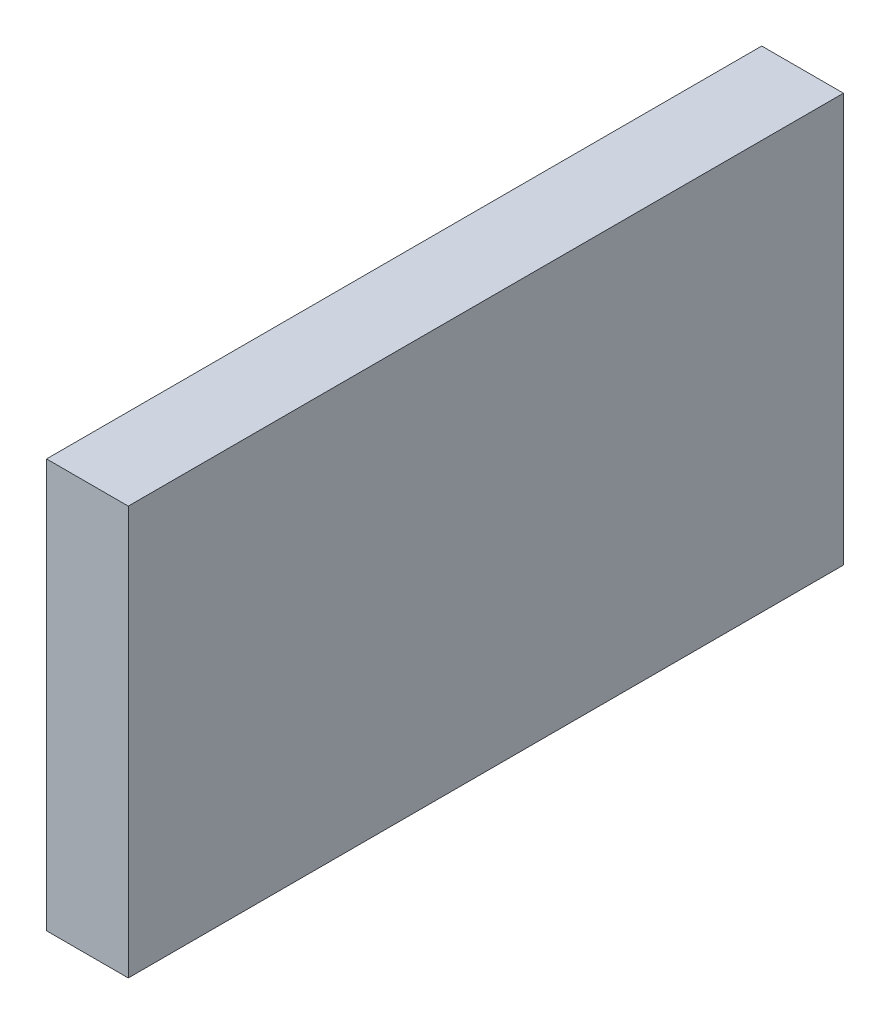
ISO-10303-21;
HEADER;
FILE_DESCRIPTION(('STEP AP214'),'2;1');
FILE_NAME('part.step','',(''),(''),'','','');
FILE_SCHEMA(('AUTOMOTIVE_DESIGN { 1 0 10303 214 1 1 1 1 }'));
ENDSEC;
DATA;
#1=APPLICATION_CONTEXT('core data for automotive mechanical design processes');
#2=APPLICATION_PROTOCOL_DEFINITION('international standard','automotive_design',2000,#1);
#3=PRODUCT_CONTEXT('',#1,'mechanical');
#4=PRODUCT('Part','Part','',(#3));
#5=PRODUCT_RELATED_PRODUCT_CATEGORY('part','',(#4));
#6=PRODUCT_DEFINITION_FORMATION('','',#4);
#7=PRODUCT_DEFINITION_CONTEXT('part definition',#1,'design');
#8=PRODUCT_DEFINITION('design','',#6,#7);
#9=PRODUCT_DEFINITION_SHAPE('','',#8);
#10=(LENGTH_UNIT() NAMED_UNIT(*) SI_UNIT(.MILLI.,.METRE.));
#11=(NAMED_UNIT(*) PLANE_ANGLE_UNIT() SI_UNIT($,.RADIAN.));
#12=(NAMED_UNIT(*) SI_UNIT($,.STERADIAN.) SOLID_ANGLE_UNIT());
#13=UNCERTAINTY_MEASURE_WITH_UNIT(LENGTH_MEASURE(1.E-05),#10,'distance_accuracy_value','');
#14=(GEOMETRIC_REPRESENTATION_CONTEXT(3) GLOBAL_UNCERTAINTY_ASSIGNED_CONTEXT((#13)) GLOBAL_UNIT_ASSIGNED_CONTEXT((#10,
#11,#12)) REPRESENTATION_CONTEXT('',''));
#15=CARTESIAN_POINT('',(0.,0.,0.));
#16=DIRECTION('',(0.,0.,1.));
#17=DIRECTION('',(1.,0.,0.));
#18=AXIS2_PLACEMENT_3D('',#15,#16,#17);
#19=CARTESIAN_POINT('',(4.,20.,-35.));
#20=DIRECTION('',(0.,0.,-1.));
#21=DIRECTION('',(-1.,0.,0.));
#22=AXIS2_PLACEMENT_3D('',#19,#20,#21);
#23=PLANE('',#22);
#24=DIRECTION('',(0.,-1.,0.));
#25=VECTOR('',#24,1.);
#26=CARTESIAN_POINT('',(0.,20.,-35.));
#27=LINE('',#26,#25);
#28=CARTESIAN_POINT('',(0.,20.,-35.));
#29=VERTEX_POINT('',#28);
#30=CARTESIAN_POINT('',(0.,0.,-35.));
#31=VERTEX_POINT('',#30);
#32=EDGE_CURVE('E97',#29,#31,#27,.T.);
#33=ORIENTED_EDGE('',*,*,#32,.F.);
#34=DIRECTION('',(-1.,0.,0.));
#35=VECTOR('',#34,1.);
#36=CARTESIAN_POINT('',(4.,20.,-35.));
#37=LINE('',#36,#35);
#38=CARTESIAN_POINT('',(4.,20.,-35.));
#39=VERTEX_POINT('',#38);
#40=EDGE_CURVE('E11',#39,#29,#37,.T.);
#41=ORIENTED_EDGE('',*,*,#40,.F.);
#42=DIRECTION('',(0.,-1.,0.));
#43=VECTOR('',#42,1.);
#44=CARTESIAN_POINT('',(4.,20.,-35.));
#45=LINE('',#44,#43);
#46=CARTESIAN_POINT('',(4.,0.,-35.));
#47=VERTEX_POINT('',#46);
#48=EDGE_CURVE('E91',#39,#47,#45,.T.);
#49=ORIENTED_EDGE('',*,*,#48,.T.);
#50=DIRECTION('',(-1.,0.,0.));
#51=VECTOR('',#50,1.);
#52=CARTESIAN_POINT('',(4.,0.,-35.));
#53=LINE('',#52,#51);
#54=EDGE_CURVE('E36',#47,#31,#53,.T.);
#55=ORIENTED_EDGE('',*,*,#54,.T.);
#56=EDGE_LOOP('',(#33,#41,#49,#55));
#57=FACE_BOUND('',#56,.T.);
#58=ADVANCED_FACE('F33',(#57),#23,.T.);
#59=CARTESIAN_POINT('',(4.,20.,0.));
#60=DIRECTION('',(0.,1.,0.));
#61=DIRECTION('',(0.,0.,1.));
#62=AXIS2_PLACEMENT_3D('',#59,#60,#61);
#63=PLANE('',#62);
#64=DIRECTION('',(0.,0.,-1.));
#65=VECTOR('',#64,1.);
#66=CARTESIAN_POINT('',(0.,20.,0.));
#67=LINE('',#66,#65);
#68=CARTESIAN_POINT('',(0.,20.,0.));
#69=VERTEX_POINT('',#68);
#70=EDGE_CURVE('E93',#69,#29,#67,.T.);
#71=ORIENTED_EDGE('',*,*,#70,.F.);
#72=DIRECTION('',(-1.,0.,0.));
#73=VECTOR('',#72,1.);
#74=CARTESIAN_POINT('',(4.,20.,0.));
#75=LINE('',#74,#73);
#76=CARTESIAN_POINT('',(4.,20.,0.));
#77=VERTEX_POINT('',#76);
#78=EDGE_CURVE('E42',#77,#69,#75,.T.);
#79=ORIENTED_EDGE('',*,*,#78,.F.);
#80=DIRECTION('',(0.,0.,-1.));
#81=VECTOR('',#80,1.);
#82=CARTESIAN_POINT('',(4.,20.,0.));
#83=LINE('',#82,#81);
#84=EDGE_CURVE('E88',#77,#39,#83,.T.);
#85=ORIENTED_EDGE('',*,*,#84,.T.);
#86=ORIENTED_EDGE('',*,*,#40,.T.);
#87=EDGE_LOOP('',(#71,#79,#85,#86));
#88=FACE_BOUND('',#87,.T.);
#89=ADVANCED_FACE('F107',(#88),#63,.T.);
#90=CARTESIAN_POINT('',(4.,0.,0.));
#91=DIRECTION('',(0.,0.,1.));
#92=DIRECTION('',(1.,0.,0.));
#93=AXIS2_PLACEMENT_3D('',#90,#91,#92);
#94=PLANE('',#93);
#95=DIRECTION('',(0.,1.,0.));
#96=VECTOR('',#95,1.);
#97=CARTESIAN_POINT('',(0.,0.,0.));
#98=LINE('',#97,#96);
#99=CARTESIAN_POINT('',(0.,0.,0.));
#100=VERTEX_POINT('',#99);
#101=EDGE_CURVE('E83',#100,#69,#98,.T.);
#102=ORIENTED_EDGE('',*,*,#101,.F.);
#103=DIRECTION('',(-1.,0.,0.));
#104=VECTOR('',#103,1.);
#105=CARTESIAN_POINT('',(4.,0.,0.));
#106=LINE('',#105,#104);
#107=CARTESIAN_POINT('',(4.,0.,0.));
#108=VERTEX_POINT('',#107);
#109=EDGE_CURVE('E78',#108,#100,#106,.T.);
#110=ORIENTED_EDGE('',*,*,#109,.F.);
#111=DIRECTION('',(0.,1.,0.));
#112=VECTOR('',#111,1.);
#113=CARTESIAN_POINT('',(4.,0.,0.));
#114=LINE('',#113,#112);
#115=EDGE_CURVE('E81',#108,#77,#114,.T.);
#116=ORIENTED_EDGE('',*,*,#115,.T.);
#117=ORIENTED_EDGE('',*,*,#78,.T.);
#118=EDGE_LOOP('',(#102,#110,#116,#117));
#119=FACE_BOUND('',#118,.T.);
#120=ADVANCED_FACE('F80',(#119),#94,.T.);
#121=CARTESIAN_POINT('',(4.,0.,-35.));
#122=DIRECTION('',(0.,-1.,0.));
#123=DIRECTION('',(0.,0.,-1.));
#124=AXIS2_PLACEMENT_3D('',#121,#122,#123);
#125=PLANE('',#124);
#126=DIRECTION('',(0.,0.,1.));
#127=VECTOR('',#126,1.);
#128=CARTESIAN_POINT('',(0.,0.,-35.));
#129=LINE('',#128,#127);
#130=EDGE_CURVE('E100',#31,#100,#129,.T.);
#131=ORIENTED_EDGE('',*,*,#130,.F.);
#132=ORIENTED_EDGE('',*,*,#54,.F.);
#133=DIRECTION('',(0.,0.,1.));
#134=VECTOR('',#133,1.);
#135=CARTESIAN_POINT('',(4.,0.,-35.));
#136=LINE('',#135,#134);
#137=EDGE_CURVE('E87',#47,#108,#136,.T.);
#138=ORIENTED_EDGE('',*,*,#137,.T.);
#139=ORIENTED_EDGE('',*,*,#109,.T.);
#140=EDGE_LOOP('',(#131,#132,#138,#139));
#141=FACE_BOUND('',#140,.T.);
#142=ADVANCED_FACE('F90',(#141),#125,.T.);
#143=CARTESIAN_POINT('',(4.,0.,0.));
#144=DIRECTION('',(-1.,0.,0.));
#145=DIRECTION('',(0.,0.,1.));
#146=AXIS2_PLACEMENT_3D('',#143,#144,#145);
#147=PLANE('',#146);
#148=ORIENTED_EDGE('',*,*,#48,.F.);
#149=ORIENTED_EDGE('',*,*,#84,.F.);
#150=ORIENTED_EDGE('',*,*,#115,.F.);
#151=ORIENTED_EDGE('',*,*,#137,.F.);
#152=EDGE_LOOP('',(#148,#149,#150,#151));
#153=FACE_BOUND('',#152,.T.);
#154=ADVANCED_FACE('F86',(#153),#147,.F.);
#155=CARTESIAN_POINT('',(0.,0.,0.));
#156=DIRECTION('',(-1.,0.,0.));
#157=DIRECTION('',(0.,0.,1.));
#158=AXIS2_PLACEMENT_3D('',#155,#156,#157);
#159=PLANE('',#158);
#160=ORIENTED_EDGE('',*,*,#32,.T.);
#161=ORIENTED_EDGE('',*,*,#130,.T.);
#162=ORIENTED_EDGE('',*,*,#101,.T.);
#163=ORIENTED_EDGE('',*,*,#70,.T.);
#164=EDGE_LOOP('',(#160,#161,#162,#163));
#165=FACE_BOUND('',#164,.T.);
#166=ADVANCED_FACE('F106',(#165),#159,.T.);
#167=CLOSED_SHELL('',(#58,#89,#120,#142,#154,#166));
#168=MANIFOLD_SOLID_BREP('B2',#167);
#169=ADVANCED_BREP_SHAPE_REPRESENTATION('',(#18,#168),#14);
#170=SHAPE_DEFINITION_REPRESENTATION(#9,#169);
ENDSEC;
END-ISO-10303-21;
